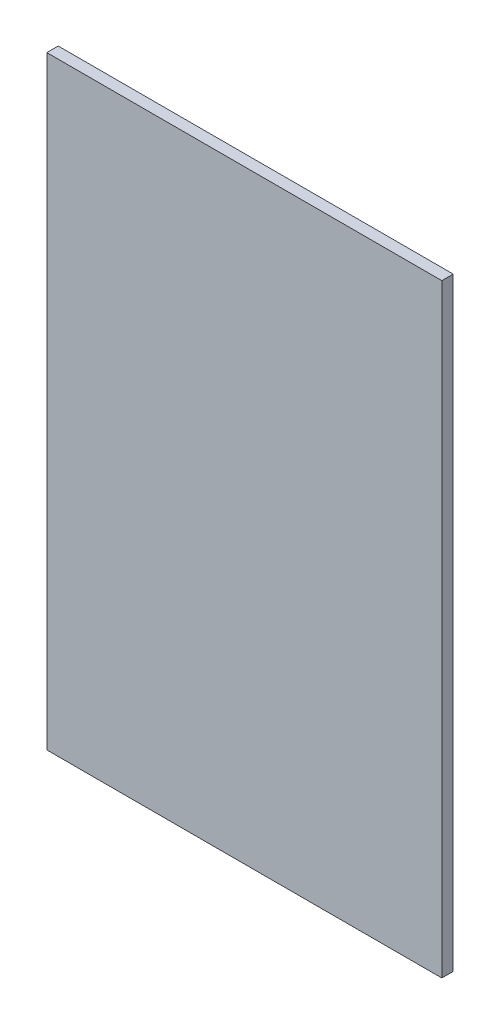
ISO-10303-21;
HEADER;
FILE_DESCRIPTION(('STEP AP214'),'2;1');
FILE_NAME('part.step','',(''),(''),'','','');
FILE_SCHEMA(('AUTOMOTIVE_DESIGN { 1 0 10303 214 1 1 1 1 }'));
ENDSEC;
DATA;
#1=APPLICATION_CONTEXT('core data for automotive mechanical design processes');
#2=APPLICATION_PROTOCOL_DEFINITION('international standard','automotive_design',2000,#1);
#3=PRODUCT_CONTEXT('',#1,'mechanical');
#4=PRODUCT('Part','Part','',(#3));
#5=PRODUCT_RELATED_PRODUCT_CATEGORY('part','',(#4));
#6=PRODUCT_DEFINITION_FORMATION('','',#4);
#7=PRODUCT_DEFINITION_CONTEXT('part definition',#1,'design');
#8=PRODUCT_DEFINITION('design','',#6,#7);
#9=PRODUCT_DEFINITION_SHAPE('','',#8);
#10=(LENGTH_UNIT() NAMED_UNIT(*) SI_UNIT(.MILLI.,.METRE.));
#11=(NAMED_UNIT(*) PLANE_ANGLE_UNIT() SI_UNIT($,.RADIAN.));
#12=(NAMED_UNIT(*) SI_UNIT($,.STERADIAN.) SOLID_ANGLE_UNIT());
#13=UNCERTAINTY_MEASURE_WITH_UNIT(LENGTH_MEASURE(1.E-05),#10,'distance_accuracy_value','');
#14=(GEOMETRIC_REPRESENTATION_CONTEXT(3) GLOBAL_UNCERTAINTY_ASSIGNED_CONTEXT((#13)) GLOBAL_UNIT_ASSIGNED_CONTEXT((#10,
#11,#12)) REPRESENTATION_CONTEXT('',''));
#15=CARTESIAN_POINT('',(0.,0.,0.));
#16=DIRECTION('',(0.,0.,1.));
#17=DIRECTION('',(1.,0.,0.));
#18=AXIS2_PLACEMENT_3D('',#15,#16,#17);
#19=CARTESIAN_POINT('',(-38.0708354021847,159.,6.));
#20=DIRECTION('',(1.,0.,0.));
#21=DIRECTION('',(0.,1.,0.));
#22=AXIS2_PLACEMENT_3D('',#19,#20,#21);
#23=PLANE('',#22);
#24=DIRECTION('',(0.,-1.,0.));
#25=VECTOR('',#24,1.);
#26=CARTESIAN_POINT('',(-38.0708354021847,159.,0.));
#27=LINE('',#26,#25);
#28=CARTESIAN_POINT('',(-38.0708354021847,159.,0.));
#29=VERTEX_POINT('',#28);
#30=CARTESIAN_POINT('',(-38.0708354021847,-159.,0.));
#31=VERTEX_POINT('',#30);
#32=EDGE_CURVE('E96',#29,#31,#27,.T.);
#33=ORIENTED_EDGE('',*,*,#32,.T.);
#34=DIRECTION('',(0.,0.,-1.));
#35=VECTOR('',#34,1.);
#36=CARTESIAN_POINT('',(-38.0708354021847,-159.,6.));
#37=LINE('',#36,#35);
#38=CARTESIAN_POINT('',(-38.0708354021847,-159.,6.));
#39=VERTEX_POINT('',#38);
#40=EDGE_CURVE('E11',#39,#31,#37,.T.);
#41=ORIENTED_EDGE('',*,*,#40,.F.);
#42=DIRECTION('',(0.,-1.,0.));
#43=VECTOR('',#42,1.);
#44=CARTESIAN_POINT('',(-38.0708354021847,159.,6.));
#45=LINE('',#44,#43);
#46=CARTESIAN_POINT('',(-38.0708354021847,159.,6.));
#47=VERTEX_POINT('',#46);
#48=EDGE_CURVE('E84',#47,#39,#45,.T.);
#49=ORIENTED_EDGE('',*,*,#48,.F.);
#50=DIRECTION('',(0.,0.,-1.));
#51=VECTOR('',#50,1.);
#52=CARTESIAN_POINT('',(-38.0708354021847,159.,6.));
#53=LINE('',#52,#51);
#54=EDGE_CURVE('E92',#47,#29,#53,.T.);
#55=ORIENTED_EDGE('',*,*,#54,.T.);
#56=EDGE_LOOP('',(#33,#41,#49,#55));
#57=FACE_BOUND('',#56,.T.);
#58=ADVANCED_FACE('F33',(#57),#23,.F.);
#59=CARTESIAN_POINT('',(-38.0708354021847,-159.,6.));
#60=DIRECTION('',(0.,1.,0.));
#61=DIRECTION('',(0.,0.,1.));
#62=AXIS2_PLACEMENT_3D('',#59,#60,#61);
#63=PLANE('',#62);
#64=DIRECTION('',(1.,0.,0.));
#65=VECTOR('',#64,1.);
#66=CARTESIAN_POINT('',(-38.0708354021847,-159.,0.));
#67=LINE('',#66,#65);
#68=CARTESIAN_POINT('',(169.929164597815,-159.,0.));
#69=VERTEX_POINT('',#68);
#70=EDGE_CURVE('E88',#31,#69,#67,.T.);
#71=ORIENTED_EDGE('',*,*,#70,.T.);
#72=DIRECTION('',(0.,0.,-1.));
#73=VECTOR('',#72,1.);
#74=CARTESIAN_POINT('',(169.929164597815,-159.,6.));
#75=LINE('',#74,#73);
#76=CARTESIAN_POINT('',(169.929164597815,-159.,6.));
#77=VERTEX_POINT('',#76);
#78=EDGE_CURVE('E41',#77,#69,#75,.T.);
#79=ORIENTED_EDGE('',*,*,#78,.F.);
#80=DIRECTION('',(1.,0.,0.));
#81=VECTOR('',#80,1.);
#82=CARTESIAN_POINT('',(-38.0708354021847,-159.,6.));
#83=LINE('',#82,#81);
#84=EDGE_CURVE('E79',#39,#77,#83,.T.);
#85=ORIENTED_EDGE('',*,*,#84,.F.);
#86=ORIENTED_EDGE('',*,*,#40,.T.);
#87=EDGE_LOOP('',(#71,#79,#85,#86));
#88=FACE_BOUND('',#87,.T.);
#89=ADVANCED_FACE('F87',(#88),#63,.F.);
#90=CARTESIAN_POINT('',(169.929164597815,159.,6.));
#91=DIRECTION('',(-1.,0.,0.));
#92=DIRECTION('',(0.,-1.,0.));
#93=AXIS2_PLACEMENT_3D('',#90,#91,#92);
#94=PLANE('',#93);
#95=DIRECTION('',(0.,1.,0.));
#96=VECTOR('',#95,1.);
#97=CARTESIAN_POINT('',(169.929164597815,159.,0.));
#98=LINE('',#97,#96);
#99=CARTESIAN_POINT('',(169.929164597815,159.,0.));
#100=VERTEX_POINT('',#99);
#101=EDGE_CURVE('E66',#69,#100,#98,.T.);
#102=ORIENTED_EDGE('',*,*,#101,.T.);
#103=DIRECTION('',(0.,0.,-1.));
#104=VECTOR('',#103,1.);
#105=CARTESIAN_POINT('',(169.929164597815,159.,6.));
#106=LINE('',#105,#104);
#107=CARTESIAN_POINT('',(169.929164597815,159.,6.));
#108=VERTEX_POINT('',#107);
#109=EDGE_CURVE('E89',#108,#100,#106,.T.);
#110=ORIENTED_EDGE('',*,*,#109,.F.);
#111=DIRECTION('',(0.,1.,0.));
#112=VECTOR('',#111,1.);
#113=CARTESIAN_POINT('',(169.929164597815,159.,6.));
#114=LINE('',#113,#112);
#115=EDGE_CURVE('E82',#77,#108,#114,.T.);
#116=ORIENTED_EDGE('',*,*,#115,.F.);
#117=ORIENTED_EDGE('',*,*,#78,.T.);
#118=EDGE_LOOP('',(#102,#110,#116,#117));
#119=FACE_BOUND('',#118,.T.);
#120=ADVANCED_FACE('F90',(#119),#94,.F.);
#121=CARTESIAN_POINT('',(-38.0708354021847,159.,6.));
#122=DIRECTION('',(0.,-1.,0.));
#123=DIRECTION('',(0.,0.,-1.));
#124=AXIS2_PLACEMENT_3D('',#121,#122,#123);
#125=PLANE('',#124);
#126=DIRECTION('',(-1.,0.,0.));
#127=VECTOR('',#126,1.);
#128=CARTESIAN_POINT('',(-38.0708354021847,159.,0.));
#129=LINE('',#128,#127);
#130=EDGE_CURVE('E72',#100,#29,#129,.T.);
#131=ORIENTED_EDGE('',*,*,#130,.T.);
#132=ORIENTED_EDGE('',*,*,#54,.F.);
#133=DIRECTION('',(-1.,0.,0.));
#134=VECTOR('',#133,1.);
#135=CARTESIAN_POINT('',(-38.0708354021847,159.,6.));
#136=LINE('',#135,#134);
#137=EDGE_CURVE('E49',#108,#47,#136,.T.);
#138=ORIENTED_EDGE('',*,*,#137,.F.);
#139=ORIENTED_EDGE('',*,*,#109,.T.);
#140=EDGE_LOOP('',(#131,#132,#138,#139));
#141=FACE_BOUND('',#140,.T.);
#142=ADVANCED_FACE('F103',(#141),#125,.F.);
#143=CARTESIAN_POINT('',(0.,0.,6.));
#144=DIRECTION('',(0.,0.,1.));
#145=DIRECTION('',(1.,0.,0.));
#146=AXIS2_PLACEMENT_3D('',#143,#144,#145);
#147=PLANE('',#146);
#148=ORIENTED_EDGE('',*,*,#48,.T.);
#149=ORIENTED_EDGE('',*,*,#84,.T.);
#150=ORIENTED_EDGE('',*,*,#115,.T.);
#151=ORIENTED_EDGE('',*,*,#137,.T.);
#152=EDGE_LOOP('',(#148,#149,#150,#151));
#153=FACE_BOUND('',#152,.T.);
#154=ADVANCED_FACE('F80',(#153),#147,.T.);
#155=CARTESIAN_POINT('',(0.,0.,0.));
#156=DIRECTION('',(0.,0.,1.));
#157=DIRECTION('',(1.,0.,0.));
#158=AXIS2_PLACEMENT_3D('',#155,#156,#157);
#159=PLANE('',#158);
#160=ORIENTED_EDGE('',*,*,#32,.F.);
#161=ORIENTED_EDGE('',*,*,#130,.F.);
#162=ORIENTED_EDGE('',*,*,#101,.F.);
#163=ORIENTED_EDGE('',*,*,#70,.F.);
#164=EDGE_LOOP('',(#160,#161,#162,#163));
#165=FACE_BOUND('',#164,.T.);
#166=ADVANCED_FACE('F106',(#165),#159,.F.);
#167=CLOSED_SHELL('',(#58,#89,#120,#142,#154,#166));
#168=MANIFOLD_SOLID_BREP('B2',#167);
#169=ADVANCED_BREP_SHAPE_REPRESENTATION('',(#18,#168),#14);
#170=SHAPE_DEFINITION_REPRESENTATION(#9,#169);
ENDSEC;
END-ISO-10303-21;
